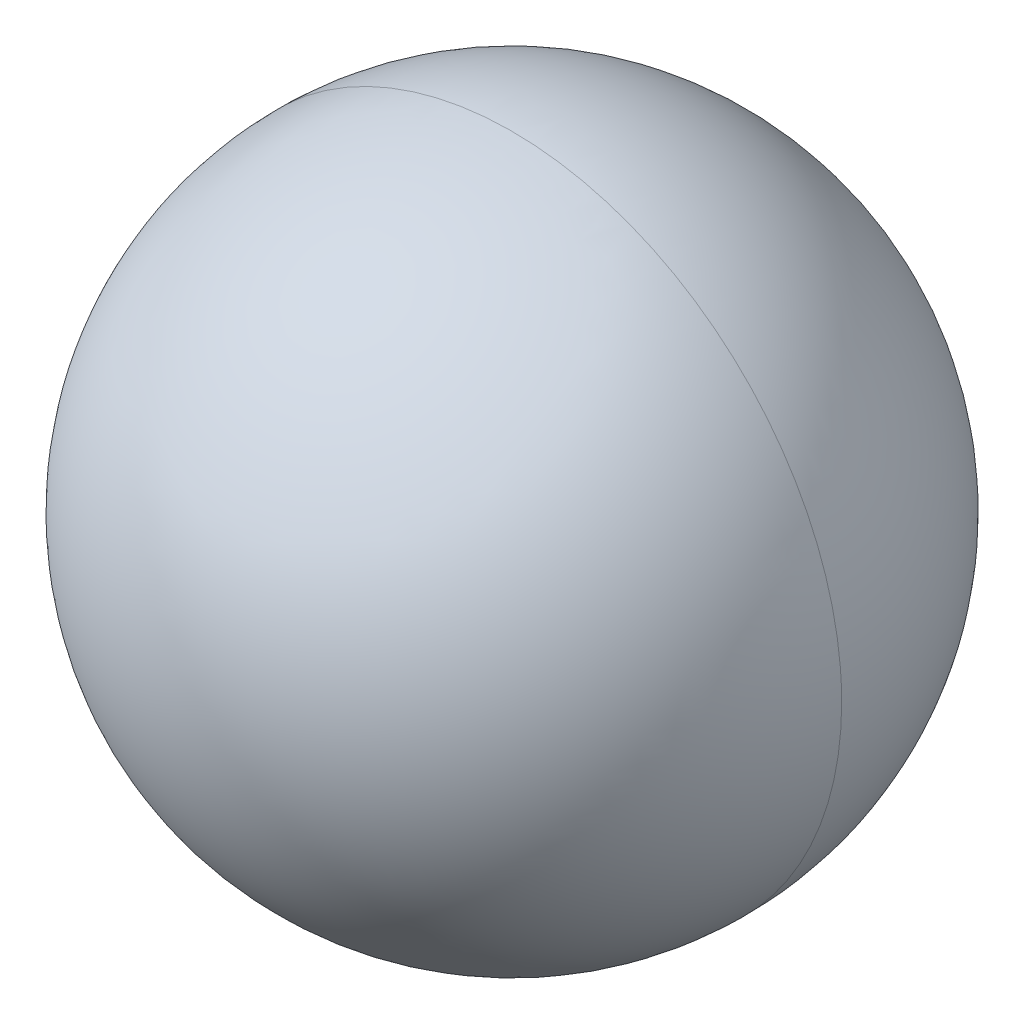
ISO-10303-21;
HEADER;
FILE_DESCRIPTION(('STEP AP214'),'2;1');
FILE_NAME('part.step','',(''),(''),'','','');
FILE_SCHEMA(('AUTOMOTIVE_DESIGN { 1 0 10303 214 1 1 1 1 }'));
ENDSEC;
DATA;
#1=APPLICATION_CONTEXT('core data for automotive mechanical design processes');
#2=APPLICATION_PROTOCOL_DEFINITION('international standard','automotive_design',2000,#1);
#3=PRODUCT_CONTEXT('',#1,'mechanical');
#4=PRODUCT('Part','Part','',(#3));
#5=PRODUCT_RELATED_PRODUCT_CATEGORY('part','',(#4));
#6=PRODUCT_DEFINITION_FORMATION('','',#4);
#7=PRODUCT_DEFINITION_CONTEXT('part definition',#1,'design');
#8=PRODUCT_DEFINITION('design','',#6,#7);
#9=PRODUCT_DEFINITION_SHAPE('','',#8);
#10=(LENGTH_UNIT() NAMED_UNIT(*) SI_UNIT(.MILLI.,.METRE.));
#11=(NAMED_UNIT(*) PLANE_ANGLE_UNIT() SI_UNIT($,.RADIAN.));
#12=(NAMED_UNIT(*) SI_UNIT($,.STERADIAN.) SOLID_ANGLE_UNIT());
#13=UNCERTAINTY_MEASURE_WITH_UNIT(LENGTH_MEASURE(1.E-05),#10,'distance_accuracy_value','');
#14=(GEOMETRIC_REPRESENTATION_CONTEXT(3) GLOBAL_UNCERTAINTY_ASSIGNED_CONTEXT((#13)) GLOBAL_UNIT_ASSIGNED_CONTEXT((#10,
#11,#12)) REPRESENTATION_CONTEXT('',''));
#15=CARTESIAN_POINT('',(0.,0.,0.));
#16=DIRECTION('',(0.,0.,1.));
#17=DIRECTION('',(1.,0.,0.));
#18=AXIS2_PLACEMENT_3D('',#15,#16,#17);
#19=CARTESIAN_POINT('',(0.,0.,0.));
#20=DIRECTION('',(1.,0.,0.));
#21=DIRECTION('',(0.,0.,1.));
#22=AXIS2_PLACEMENT_3D('',#19,#20,#21);
#23=SPHERICAL_SURFACE('',#22,2.1);
#24=CARTESIAN_POINT('',(0.,0.,0.));
#25=DIRECTION('',(0.,0.,1.));
#26=DIRECTION('',(0.,-1.,0.));
#27=AXIS2_PLACEMENT_3D('',#24,#25,#26);
#28=CIRCLE('',#27,2.1);
#29=CARTESIAN_POINT('',(-2.1,0.,0.));
#30=VERTEX_POINT('',#29);
#31=CARTESIAN_POINT('',(2.1,0.,0.));
#32=VERTEX_POINT('',#31);
#33=EDGE_CURVE('E11',#30,#32,#28,.T.);
#34=ORIENTED_EDGE('',*,*,#33,.F.);
#35=CARTESIAN_POINT('',(-2.1,0.,0.));
#36=CARTESIAN_POINT('',(-2.10000072888643,0.0343612043478674,0.));
#37=CARTESIAN_POINT('',(-2.09915667596282,0.0687223466746448,0.));
#38=CARTESIAN_POINT('',(-2.0957842400989,0.137361885500507,0.));
#39=CARTESIAN_POINT('',(-2.09325585715859,0.171640281999592,0.));
#40=CARTESIAN_POINT('',(-2.08651999486463,0.240031707384559,0.));
#41=CARTESIAN_POINT('',(-2.08231251551099,0.274144736270442,0.));
#42=CARTESIAN_POINT('',(-2.0722288263411,0.342123256442074,0.));
#43=CARTESIAN_POINT('',(-2.06635261652485,0.375988747727824,0.));
#44=CARTESIAN_POINT('',(-2.05294556116872,0.443390604739912,0.));
#45=CARTESIAN_POINT('',(-2.04541471562882,0.47692697046625,0.));
#46=CARTESIAN_POINT('',(-2.02871654778826,0.543589785127455,0.));
#47=CARTESIAN_POINT('',(-2.01954922548759,0.576716234062322,0.));
#48=CARTESIAN_POINT('',(-1.99960018458768,0.642479410406416,0.));
#49=CARTESIAN_POINT('',(-1.98881846598844,0.675116137815644,0.));
#50=CARTESIAN_POINT('',(-1.96566660778025,0.739821246431676,0.));
#51=CARTESIAN_POINT('',(-1.95329646817129,0.771889627638481,0.));
#52=CARTESIAN_POINT('',(-1.92699756837612,0.835380788294892,0.));
#53=CARTESIAN_POINT('',(-1.9130688081899,0.866803567744497,0.));
#54=CARTESIAN_POINT('',(-1.88368622292856,0.928927824662683,0.));
#55=CARTESIAN_POINT('',(-1.86823239785343,0.959629302131263,0.));
#56=CARTESIAN_POINT('',(-1.83583691240967,1.02023699253792,0.));
#57=CARTESIAN_POINT('',(-1.81889525204103,1.050143205476,0.));
#58=CARTESIAN_POINT('',(-1.78356490996011,1.10908832013552,0.));
#59=CARTESIAN_POINT('',(-1.76517622824783,1.13812722185696,0.));
#60=CARTESIAN_POINT('',(-1.72699614342287,1.19526775682536,0.));
#61=CARTESIAN_POINT('',(-1.70720474031019,1.22336939007233,0.));
#62=CARTESIAN_POINT('',(-1.66626689190852,1.27856768879589,0.));
#63=CARTESIAN_POINT('',(-1.64512044661952,1.30566435427249,0.));
#64=CARTESIAN_POINT('',(-1.60152345750398,1.35878743921481,0.));
#65=CARTESIAN_POINT('',(-1.57907291367745,1.38481385868053,0.));
#66=CARTESIAN_POINT('',(-1.53292181281339,1.43573375167694,0.));
#67=CARTESIAN_POINT('',(-1.50922125577586,1.46062722520764,0.));
#68=CARTESIAN_POINT('',(-1.46062722520764,1.50922125577586,0.));
#69=CARTESIAN_POINT('',(-1.43573375167695,1.53292181281338,0.));
#70=CARTESIAN_POINT('',(-1.38481385868053,1.57907291367744,0.));
#71=CARTESIAN_POINT('',(-1.35878743921482,1.60152345750397,0.));
#72=CARTESIAN_POINT('',(-1.3056643542725,1.64512044661952,0.));
#73=CARTESIAN_POINT('',(-1.2785676887959,1.66626689190854,0.));
#74=CARTESIAN_POINT('',(-1.22336939007233,1.70720474031016,0.));
#75=CARTESIAN_POINT('',(-1.19526775682536,1.72699614342276,0.));
#76=CARTESIAN_POINT('',(-1.13812722185697,1.76517622824792,0.));
#77=CARTESIAN_POINT('',(-1.10908832013555,1.78356490996048,0.));
#78=CARTESIAN_POINT('',(-1.05014320547599,1.81889525204066,0.));
#79=CARTESIAN_POINT('',(-1.02023699253786,1.83583691240827,0.));
#80=CARTESIAN_POINT('',(-0.959629302131336,1.86823239785482,0.));
#81=CARTESIAN_POINT('',(-0.928927824662943,1.88368622293375,0.));
#82=CARTESIAN_POINT('',(-0.866803567744248,1.91306880818471,0.));
#83=CARTESIAN_POINT('',(-0.835380788293946,1.92699756835675,0.));
#84=CARTESIAN_POINT('',(-0.771889627639438,1.95329646819065,0.));
#85=CARTESIAN_POINT('',(-0.739821246435233,1.96566660785252,0.));
#86=CARTESIAN_POINT('',(-0.675116137812099,1.98881846591616,0.));
#87=CARTESIAN_POINT('',(-0.64247941039317,1.99960018431792,0.));
#88=CARTESIAN_POINT('',(-0.57671623407558,2.01954922575735,0.));
#89=CARTESIAN_POINT('',(-0.543589785176919,2.02871654879501,0.));
#90=CARTESIAN_POINT('',(-0.476926970416797,2.04541471462207,0.));
#91=CARTESIAN_POINT('',(-0.443390604555336,2.05294555741147,0.));
#92=CARTESIAN_POINT('',(-0.375988747912411,2.0663526202821,0.));
#93=CARTESIAN_POINT('',(-0.342123257130948,2.07222884036333,0.));
#94=CARTESIAN_POINT('',(-0.274144735581579,2.08231250148875,0.));
#95=CARTESIAN_POINT('',(-0.240031704813674,2.08651994253294,0.));
#96=CARTESIAN_POINT('',(-0.171640284570489,2.09325590949028,0.));
#97=CARTESIAN_POINT('',(-0.137361895095209,2.09578443540343,0.));
#98=CARTESIAN_POINT('',(-0.0687223370799547,2.09915648065829,0.));
#99=CARTESIAN_POINT('',(-0.0343611685399795,2.1,0.));
#100=CARTESIAN_POINT('',(0.034361168539971,2.1,0.));
#101=CARTESIAN_POINT('',(0.0687223370799462,2.09915648065829,0.));
#102=CARTESIAN_POINT('',(0.137361895095201,2.09578443540343,0.));
#103=CARTESIAN_POINT('',(0.171640284570481,2.09325590949028,0.));
#104=CARTESIAN_POINT('',(0.240031704813666,2.08651994253294,0.));
#105=CARTESIAN_POINT('',(0.274144735581571,2.08231250148875,0.));
#106=CARTESIAN_POINT('',(0.34212325713094,2.07222884036333,0.));
#107=CARTESIAN_POINT('',(0.375988747912403,2.0663526202821,0.));
#108=CARTESIAN_POINT('',(0.443390604555327,2.05294555741147,0.));
#109=CARTESIAN_POINT('',(0.476926970416789,2.04541471462207,0.));
#110=CARTESIAN_POINT('',(0.543589785176911,2.02871654879501,0.));
#111=CARTESIAN_POINT('',(0.576716234075572,2.01954922575735,0.));
#112=CARTESIAN_POINT('',(0.642479410393162,1.99960018431793,0.));
#113=CARTESIAN_POINT('',(0.675116137812091,1.98881846591616,0.));
#114=CARTESIAN_POINT('',(0.739821246435226,1.96566660785253,0.));
#115=CARTESIAN_POINT('',(0.771889627639431,1.95329646819066,0.));
#116=CARTESIAN_POINT('',(0.835380788293938,1.92699756835675,0.));
#117=CARTESIAN_POINT('',(0.86680356774424,1.91306880818472,0.));
#118=CARTESIAN_POINT('',(0.928927824662935,1.88368622293375,0.));
#119=CARTESIAN_POINT('',(0.959629302131328,1.86823239785482,0.));
#120=CARTESIAN_POINT('',(1.02023699253785,1.83583691240828,0.));
#121=CARTESIAN_POINT('',(1.05014320547598,1.81889525204066,0.));
#122=CARTESIAN_POINT('',(1.10908832013554,1.78356490996049,0.));
#123=CARTESIAN_POINT('',(1.13812722185696,1.76517622824793,0.));
#124=CARTESIAN_POINT('',(1.19526775682536,1.72699614342277,0.));
#125=CARTESIAN_POINT('',(1.22336939007232,1.70720474031017,0.));
#126=CARTESIAN_POINT('',(1.27856768879589,1.66626689190855,0.));
#127=CARTESIAN_POINT('',(1.30566435427249,1.64512044661953,0.));
#128=CARTESIAN_POINT('',(1.35878743921481,1.60152345750398,0.));
#129=CARTESIAN_POINT('',(1.38481385868053,1.57907291367745,0.));
#130=CARTESIAN_POINT('',(1.43573375167694,1.53292181281339,0.));
#131=CARTESIAN_POINT('',(1.46062722520764,1.50922125577586,0.));
#132=CARTESIAN_POINT('',(1.50922125577586,1.46062722520764,0.));
#133=CARTESIAN_POINT('',(1.53292181281338,1.43573375167695,0.));
#134=CARTESIAN_POINT('',(1.57907291367744,1.38481385868054,0.));
#135=CARTESIAN_POINT('',(1.60152345750398,1.35878743921482,0.));
#136=CARTESIAN_POINT('',(1.64512044661951,1.3056643542725,0.));
#137=CARTESIAN_POINT('',(1.66626689190851,1.2785676887959,0.));
#138=CARTESIAN_POINT('',(1.70720474031019,1.22336939007233,0.));
#139=CARTESIAN_POINT('',(1.72699614342286,1.19526775682537,0.));
#140=CARTESIAN_POINT('',(1.76517622824782,1.13812722185697,0.));
#141=CARTESIAN_POINT('',(1.78356490996011,1.10908832013553,0.));
#142=CARTESIAN_POINT('',(1.81889525204103,1.05014320547601,0.));
#143=CARTESIAN_POINT('',(1.83583691240966,1.02023699253793,0.));
#144=CARTESIAN_POINT('',(1.86823239785342,0.95962930213127,0.));
#145=CARTESIAN_POINT('',(1.88368622292856,0.928927824662691,0.));
#146=CARTESIAN_POINT('',(1.9130688081899,0.866803567744505,0.));
#147=CARTESIAN_POINT('',(1.92699756837611,0.835380788294899,0.));
#148=CARTESIAN_POINT('',(1.95329646817129,0.771889627638488,0.));
#149=CARTESIAN_POINT('',(1.96566660778024,0.739821246431683,0.));
#150=CARTESIAN_POINT('',(1.98881846598844,0.675116137815651,0.));
#151=CARTESIAN_POINT('',(1.99960018458768,0.642479410406423,0.));
#152=CARTESIAN_POINT('',(2.01954922548759,0.576716234062329,0.));
#153=CARTESIAN_POINT('',(2.02871654778826,0.543589785127462,0.));
#154=CARTESIAN_POINT('',(2.04541471562882,0.476926970466257,0.));
#155=CARTESIAN_POINT('',(2.05294556116872,0.443390604739919,0.));
#156=CARTESIAN_POINT('',(2.06635261652485,0.375988747727832,0.));
#157=CARTESIAN_POINT('',(2.07222882634109,0.342123256442082,0.));
#158=CARTESIAN_POINT('',(2.08231251551099,0.27414473627045,0.));
#159=CARTESIAN_POINT('',(2.08651999486463,0.240031707384568,0.));
#160=CARTESIAN_POINT('',(2.09325585715859,0.171640281999601,0.));
#161=CARTESIAN_POINT('',(2.0957842400989,0.137361885500516,0.));
#162=CARTESIAN_POINT('',(2.09915667596282,0.0687223466746538,0.));
#163=CARTESIAN_POINT('',(2.10000072888643,0.0343612043478761,0.));
#164=CARTESIAN_POINT('',(2.1,0.,0.));
#165=B_SPLINE_CURVE_WITH_KNOTS('',3,(#35,#36,#37,#38,#39,#40,#41,#42,#43,#44,#45,#46,#47,#48,
#49,#50,#51,#52,#53,#54,#55,#56,#57,#58,#59,#60,#61,#62,#63,#64,#65,#66,#67,#68,#69,#70,#71,#72,
#73,#74,#75,#76,#77,#78,#79,#80,#81,#82,#83,#84,#85,#86,#87,#88,#89,#90,#91,#92,#93,#94,#95,#96,
#97,#98,#99,#100,#101,#102,#103,#104,#105,#106,#107,#108,#109,#110,#111,#112,#113,#114,#115,
#116,#117,#118,#119,#120,#121,#122,#123,#124,#125,#126,#127,#128,#129,#130,#131,#132,#133,#134,
#135,#136,#137,#138,#139,#140,#141,#142,#143,#144,#145,#146,#147,#148,#149,#150,#151,#152,#153,
#154,#155,#156,#157,#158,#159,#160,#161,#162,#163,#164),.UNSPECIFIED.,.F.,.F.,(4,2,2,2,2,2,2,2,
2,2,2,2,2,2,2,2,2,2,2,2,2,2,2,2,2,2,2,2,2,2,2,2,2,2,2,2,2,2,2,2,2,2,2,2,2,2,2,2,2,2,2,2,2,2,2,2,
2,2,2,2,2,2,2,2,4),(0.,0.103073159796231,0.206146319592463,0.309219479388695,0.412292639184926,
0.515365798981158,0.61843895877739,0.721512118573621,0.824585278369853,0.927658438166084,
1.03073159796232,1.13380475775855,1.23687791755478,1.33995107735101,1.44302423714724,
1.54609739694347,1.6491705567397,1.75224371653594,1.85531687633217,1.9583900361284,
2.06146319592463,2.16453635572086,2.26760951551709,2.37068267531333,2.47375583510956,
2.57682899490579,2.67990215470202,2.78297531449825,2.88604847429448,2.98912163409071,
3.09219479388695,3.19526795368318,3.29834111347941,3.40141427327564,3.50448743307187,
3.6075605928681,3.71063375266433,3.81370691246057,3.9167800722568,4.01985323205303,
4.12292639184926,4.22599955164549,4.32907271144172,4.43214587123795,4.53521903103419,
4.63829219083042,4.74136535062665,4.84443851042288,4.94751167021911,5.05058483001534,
5.15365798981158,5.25673114960781,5.35980430940404,5.46287746920027,5.5659506289965,
5.66902378879273,5.77209694858897,5.8751701083852,5.97824326818143,6.08131642797766,
6.18438958777389,6.28746274757012,6.39053590736636,6.49360906716259,6.59668222695882),.UNSPECIFIED.);
#166=EDGE_CURVE('E25',#30,#32,#165,.T.);
#167=ORIENTED_EDGE('',*,*,#166,.T.);
#168=EDGE_LOOP('',(#34,#167));
#169=FACE_BOUND('',#168,.T.);
#170=ADVANCED_FACE('F16',(#169),#23,.T.);
#171=CARTESIAN_POINT('',(0.,0.,0.));
#172=DIRECTION('',(1.,0.,0.));
#173=DIRECTION('',(0.,0.,-1.));
#174=AXIS2_PLACEMENT_3D('',#171,#172,#173);
#175=SPHERICAL_SURFACE('',#174,2.1);
#176=ORIENTED_EDGE('',*,*,#33,.T.);
#177=ORIENTED_EDGE('',*,*,#166,.F.);
#178=EDGE_LOOP('',(#176,#177));
#179=FACE_BOUND('',#178,.T.);
#180=ADVANCED_FACE('F35',(#179),#175,.T.);
#181=CLOSED_SHELL('',(#170,#180));
#182=MANIFOLD_SOLID_BREP('B1',#181);
#183=ADVANCED_BREP_SHAPE_REPRESENTATION('',(#18,#182),#14);
#184=SHAPE_DEFINITION_REPRESENTATION(#9,#183);
ENDSEC;
END-ISO-10303-21;
